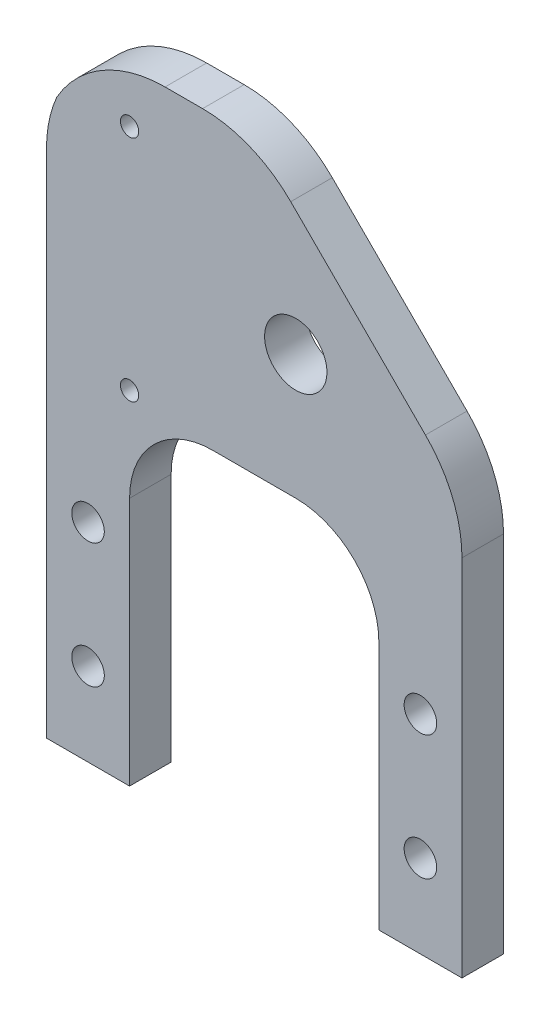
ISO-10303-21;
HEADER;
FILE_DESCRIPTION(('STEP AP214'),'2;1');
FILE_NAME('part.step','',(''),(''),'','','');
FILE_SCHEMA(('AUTOMOTIVE_DESIGN { 1 0 10303 214 1 1 1 1 }'));
ENDSEC;
DATA;
#1=APPLICATION_CONTEXT('core data for automotive mechanical design processes');
#2=APPLICATION_PROTOCOL_DEFINITION('international standard','automotive_design',2000,#1);
#3=PRODUCT_CONTEXT('',#1,'mechanical');
#4=PRODUCT('Part','Part','',(#3));
#5=PRODUCT_RELATED_PRODUCT_CATEGORY('part','',(#4));
#6=PRODUCT_DEFINITION_FORMATION('','',#4);
#7=PRODUCT_DEFINITION_CONTEXT('part definition',#1,'design');
#8=PRODUCT_DEFINITION('design','',#6,#7);
#9=PRODUCT_DEFINITION_SHAPE('','',#8);
#10=(LENGTH_UNIT() NAMED_UNIT(*) SI_UNIT(.MILLI.,.METRE.));
#11=(NAMED_UNIT(*) PLANE_ANGLE_UNIT() SI_UNIT($,.RADIAN.));
#12=(NAMED_UNIT(*) SI_UNIT($,.STERADIAN.) SOLID_ANGLE_UNIT());
#13=UNCERTAINTY_MEASURE_WITH_UNIT(LENGTH_MEASURE(1.E-05),#10,'distance_accuracy_value','');
#14=(GEOMETRIC_REPRESENTATION_CONTEXT(3) GLOBAL_UNCERTAINTY_ASSIGNED_CONTEXT((#13)) GLOBAL_UNIT_ASSIGNED_CONTEXT((#10,
#11,#12)) REPRESENTATION_CONTEXT('',''));
#15=CARTESIAN_POINT('',(0.,0.,0.));
#16=DIRECTION('',(0.,0.,1.));
#17=DIRECTION('',(1.,0.,0.));
#18=AXIS2_PLACEMENT_3D('',#15,#16,#17);
#19=CARTESIAN_POINT('',(0.,0.,6.35));
#20=DIRECTION('',(1.,0.,0.));
#21=DIRECTION('',(0.,0.,-1.));
#22=AXIS2_PLACEMENT_3D('',#19,#20,#21);
#23=PLANE('',#22);
#24=DIRECTION('',(0.,-1.,0.));
#25=VECTOR('',#24,1.);
#26=CARTESIAN_POINT('',(0.,0.,6.35));
#27=LINE('',#26,#25);
#28=CARTESIAN_POINT('',(0.,78.052905028629,6.35));
#29=VERTEX_POINT('',#28);
#30=CARTESIAN_POINT('',(0.,0.,6.35));
#31=VERTEX_POINT('',#30);
#32=EDGE_CURVE('E142',#29,#31,#27,.T.);
#33=ORIENTED_EDGE('',*,*,#32,.F.);
#34=DIRECTION('',(0.,0.,-1.));
#35=VECTOR('',#34,1.);
#36=CARTESIAN_POINT('',(0.,78.052905028629,6.35));
#37=LINE('',#36,#35);
#38=CARTESIAN_POINT('',(0.,78.052905028629,0.));
#39=VERTEX_POINT('',#38);
#40=EDGE_CURVE('E44',#29,#39,#37,.T.);
#41=ORIENTED_EDGE('',*,*,#40,.T.);
#42=DIRECTION('',(0.,-1.,0.));
#43=VECTOR('',#42,1.);
#44=CARTESIAN_POINT('',(0.,0.,0.));
#45=LINE('',#44,#43);
#46=CARTESIAN_POINT('',(0.,0.,0.));
#47=VERTEX_POINT('',#46);
#48=EDGE_CURVE('E167',#39,#47,#45,.T.);
#49=ORIENTED_EDGE('',*,*,#48,.T.);
#50=DIRECTION('',(0.,0.,-1.));
#51=VECTOR('',#50,1.);
#52=CARTESIAN_POINT('',(0.,0.,6.35));
#53=LINE('',#52,#51);
#54=EDGE_CURVE('E160',#31,#47,#53,.T.);
#55=ORIENTED_EDGE('',*,*,#54,.F.);
#56=EDGE_LOOP('',(#33,#41,#49,#55));
#57=FACE_BOUND('',#56,.T.);
#58=ADVANCED_FACE('F35',(#57),#23,.F.);
#59=CARTESIAN_POINT('',(0.,0.,6.35));
#60=DIRECTION('',(0.,1.,0.));
#61=DIRECTION('',(0.,0.,1.));
#62=AXIS2_PLACEMENT_3D('',#59,#60,#61);
#63=PLANE('',#62);
#64=DIRECTION('',(1.,0.,0.));
#65=VECTOR('',#64,1.);
#66=CARTESIAN_POINT('',(0.,0.,0.));
#67=LINE('',#66,#65);
#68=CARTESIAN_POINT('',(12.7,0.,0.));
#69=VERTEX_POINT('',#68);
#70=EDGE_CURVE('E222',#47,#69,#67,.T.);
#71=ORIENTED_EDGE('',*,*,#70,.T.);
#72=DIRECTION('',(0.,0.,-1.));
#73=VECTOR('',#72,1.);
#74=CARTESIAN_POINT('',(12.7,0.,6.35));
#75=LINE('',#74,#73);
#76=CARTESIAN_POINT('',(12.7,0.,6.35));
#77=VERTEX_POINT('',#76);
#78=EDGE_CURVE('E162',#77,#69,#75,.T.);
#79=ORIENTED_EDGE('',*,*,#78,.F.);
#80=DIRECTION('',(1.,0.,0.));
#81=VECTOR('',#80,1.);
#82=CARTESIAN_POINT('',(0.,0.,6.35));
#83=LINE('',#82,#81);
#84=EDGE_CURVE('E147',#31,#77,#83,.T.);
#85=ORIENTED_EDGE('',*,*,#84,.F.);
#86=ORIENTED_EDGE('',*,*,#54,.T.);
#87=EDGE_LOOP('',(#71,#79,#85,#86));
#88=FACE_BOUND('',#87,.T.);
#89=ADVANCED_FACE('F159',(#88),#63,.F.);
#90=CARTESIAN_POINT('',(12.7,0.,6.35));
#91=DIRECTION('',(-1.,0.,0.));
#92=DIRECTION('',(0.,0.,1.));
#93=AXIS2_PLACEMENT_3D('',#90,#91,#92);
#94=PLANE('',#93);
#95=DIRECTION('',(0.,1.,0.));
#96=VECTOR('',#95,1.);
#97=CARTESIAN_POINT('',(12.7,0.,0.));
#98=LINE('',#97,#96);
#99=CARTESIAN_POINT('',(12.7,38.1,0.));
#100=VERTEX_POINT('',#99);
#101=EDGE_CURVE('E225',#69,#100,#98,.T.);
#102=ORIENTED_EDGE('',*,*,#101,.T.);
#103=DIRECTION('',(0.,0.,-1.));
#104=VECTOR('',#103,1.);
#105=CARTESIAN_POINT('',(12.7,38.1,6.35));
#106=LINE('',#105,#104);
#107=CARTESIAN_POINT('',(12.7,38.1,6.35));
#108=VERTEX_POINT('',#107);
#109=EDGE_CURVE('E182',#100,#108,#106,.F.);
#110=ORIENTED_EDGE('',*,*,#109,.T.);
#111=DIRECTION('',(0.,1.,0.));
#112=VECTOR('',#111,1.);
#113=CARTESIAN_POINT('',(12.7,0.,6.35));
#114=LINE('',#113,#112);
#115=EDGE_CURVE('E164',#77,#108,#114,.T.);
#116=ORIENTED_EDGE('',*,*,#115,.F.);
#117=ORIENTED_EDGE('',*,*,#78,.T.);
#118=EDGE_LOOP('',(#102,#110,#116,#117));
#119=FACE_BOUND('',#118,.T.);
#120=ADVANCED_FACE('F363',(#119),#94,.F.);
#121=CARTESIAN_POINT('',(12.7,50.8,6.35));
#122=DIRECTION('',(0.,1.,0.));
#123=DIRECTION('',(0.,0.,1.));
#124=AXIS2_PLACEMENT_3D('',#121,#122,#123);
#125=PLANE('',#124);
#126=DIRECTION('',(1.,0.,0.));
#127=VECTOR('',#126,1.);
#128=CARTESIAN_POINT('',(12.7,50.8,0.));
#129=LINE('',#128,#127);
#130=CARTESIAN_POINT('',(25.4,50.8,0.));
#131=VERTEX_POINT('',#130);
#132=CARTESIAN_POINT('',(38.1,50.8,0.));
#133=VERTEX_POINT('',#132);
#134=EDGE_CURVE('E236',#131,#133,#129,.T.);
#135=ORIENTED_EDGE('',*,*,#134,.T.);
#136=DIRECTION('',(0.,0.,-1.));
#137=VECTOR('',#136,1.);
#138=CARTESIAN_POINT('',(38.1,50.8,6.35));
#139=LINE('',#138,#137);
#140=CARTESIAN_POINT('',(38.1,50.8,6.35));
#141=VERTEX_POINT('',#140);
#142=EDGE_CURVE('E180',#133,#141,#139,.F.);
#143=ORIENTED_EDGE('',*,*,#142,.T.);
#144=DIRECTION('',(1.,0.,0.));
#145=VECTOR('',#144,1.);
#146=CARTESIAN_POINT('',(12.7,50.8,6.35));
#147=LINE('',#146,#145);
#148=CARTESIAN_POINT('',(25.4,50.8,6.35));
#149=VERTEX_POINT('',#148);
#150=EDGE_CURVE('E281',#149,#141,#147,.T.);
#151=ORIENTED_EDGE('',*,*,#150,.F.);
#152=DIRECTION('',(0.,0.,-1.));
#153=VECTOR('',#152,1.);
#154=CARTESIAN_POINT('',(25.4,50.8,0.));
#155=LINE('',#154,#153);
#156=EDGE_CURVE('E172',#149,#131,#155,.T.);
#157=ORIENTED_EDGE('',*,*,#156,.T.);
#158=EDGE_LOOP('',(#135,#143,#151,#157));
#159=FACE_BOUND('',#158,.T.);
#160=ADVANCED_FACE('F405',(#159),#125,.F.);
#161=CARTESIAN_POINT('',(50.8,50.8,6.35));
#162=DIRECTION('',(1.,0.,0.));
#163=DIRECTION('',(0.,0.,-1.));
#164=AXIS2_PLACEMENT_3D('',#161,#162,#163);
#165=PLANE('',#164);
#166=DIRECTION('',(0.,-1.,0.));
#167=VECTOR('',#166,1.);
#168=CARTESIAN_POINT('',(50.8,50.8,6.35));
#169=LINE('',#168,#167);
#170=CARTESIAN_POINT('',(50.8,38.1,6.35));
#171=VERTEX_POINT('',#170);
#172=CARTESIAN_POINT('',(50.8,0.,6.35));
#173=VERTEX_POINT('',#172);
#174=EDGE_CURVE('E279',#171,#173,#169,.T.);
#175=ORIENTED_EDGE('',*,*,#174,.F.);
#176=DIRECTION('',(0.,0.,-1.));
#177=VECTOR('',#176,1.);
#178=CARTESIAN_POINT('',(50.8,38.1,0.));
#179=LINE('',#178,#177);
#180=CARTESIAN_POINT('',(50.8,38.1,0.));
#181=VERTEX_POINT('',#180);
#182=EDGE_CURVE('E169',#171,#181,#179,.T.);
#183=ORIENTED_EDGE('',*,*,#182,.T.);
#184=DIRECTION('',(0.,-1.,0.));
#185=VECTOR('',#184,1.);
#186=CARTESIAN_POINT('',(50.8,50.8,0.));
#187=LINE('',#186,#185);
#188=CARTESIAN_POINT('',(50.8,0.,0.));
#189=VERTEX_POINT('',#188);
#190=EDGE_CURVE('E239',#181,#189,#187,.T.);
#191=ORIENTED_EDGE('',*,*,#190,.T.);
#192=DIRECTION('',(0.,0.,-1.));
#193=VECTOR('',#192,1.);
#194=CARTESIAN_POINT('',(50.8,0.,6.35));
#195=LINE('',#194,#193);
#196=EDGE_CURVE('E174',#173,#189,#195,.T.);
#197=ORIENTED_EDGE('',*,*,#196,.F.);
#198=EDGE_LOOP('',(#175,#183,#191,#197));
#199=FACE_BOUND('',#198,.T.);
#200=ADVANCED_FACE('F402',(#199),#165,.F.);
#201=CARTESIAN_POINT('',(50.8,0.,6.35));
#202=DIRECTION('',(0.,1.,0.));
#203=DIRECTION('',(0.,0.,1.));
#204=AXIS2_PLACEMENT_3D('',#201,#202,#203);
#205=PLANE('',#204);
#206=DIRECTION('',(1.,0.,0.));
#207=VECTOR('',#206,1.);
#208=CARTESIAN_POINT('',(50.8,0.,0.));
#209=LINE('',#208,#207);
#210=CARTESIAN_POINT('',(63.5,0.,0.));
#211=VERTEX_POINT('',#210);
#212=EDGE_CURVE('E241',#189,#211,#209,.T.);
#213=ORIENTED_EDGE('',*,*,#212,.T.);
#214=DIRECTION('',(0.,0.,-1.));
#215=VECTOR('',#214,1.);
#216=CARTESIAN_POINT('',(63.5,0.,6.35));
#217=LINE('',#216,#215);
#218=CARTESIAN_POINT('',(63.5,0.,6.35));
#219=VERTEX_POINT('',#218);
#220=EDGE_CURVE('E250',#219,#211,#217,.T.);
#221=ORIENTED_EDGE('',*,*,#220,.F.);
#222=DIRECTION('',(1.,0.,0.));
#223=VECTOR('',#222,1.);
#224=CARTESIAN_POINT('',(50.8,0.,6.35));
#225=LINE('',#224,#223);
#226=EDGE_CURVE('E259',#173,#219,#225,.T.);
#227=ORIENTED_EDGE('',*,*,#226,.F.);
#228=ORIENTED_EDGE('',*,*,#196,.T.);
#229=EDGE_LOOP('',(#213,#221,#227,#228));
#230=FACE_BOUND('',#229,.T.);
#231=ADVANCED_FACE('F257',(#230),#205,.F.);
#232=CARTESIAN_POINT('',(63.5,0.,6.35));
#233=DIRECTION('',(-1.,0.,0.));
#234=DIRECTION('',(0.,0.,1.));
#235=AXIS2_PLACEMENT_3D('',#232,#233,#234);
#236=PLANE('',#235);
#237=DIRECTION('',(0.,1.,0.));
#238=VECTOR('',#237,1.);
#239=CARTESIAN_POINT('',(63.5,0.,0.));
#240=LINE('',#239,#238);
#241=CARTESIAN_POINT('',(63.5,55.6092316367925,0.));
#242=VERTEX_POINT('',#241);
#243=EDGE_CURVE('E243',#211,#242,#240,.T.);
#244=ORIENTED_EDGE('',*,*,#243,.T.);
#245=DIRECTION('',(0.,0.,-1.));
#246=VECTOR('',#245,1.);
#247=CARTESIAN_POINT('',(63.5,55.6092316367925,6.35));
#248=LINE('',#247,#246);
#249=CARTESIAN_POINT('',(63.5,55.6092316367925,6.35));
#250=VERTEX_POINT('',#249);
#251=EDGE_CURVE('E11',#242,#250,#248,.F.);
#252=ORIENTED_EDGE('',*,*,#251,.T.);
#253=DIRECTION('',(0.,1.,0.));
#254=VECTOR('',#253,1.);
#255=CARTESIAN_POINT('',(63.5,0.,6.35));
#256=LINE('',#255,#254);
#257=EDGE_CURVE('E272',#219,#250,#256,.T.);
#258=ORIENTED_EDGE('',*,*,#257,.F.);
#259=ORIENTED_EDGE('',*,*,#220,.T.);
#260=EDGE_LOOP('',(#244,#252,#258,#259));
#261=FACE_BOUND('',#260,.T.);
#262=ADVANCED_FACE('F265',(#261),#236,.F.);
#263=CARTESIAN_POINT('',(31.75,95.25,6.35));
#264=DIRECTION('',(-0.707106781186548,-0.707106781186548,0.));
#265=DIRECTION('',(0.707106781186548,-0.707106781186548,0.));
#266=AXIS2_PLACEMENT_3D('',#263,#264,#265);
#267=PLANE('',#266);
#268=DIRECTION('',(-0.707106781186548,0.707106781186548,0.));
#269=VECTOR('',#268,1.);
#270=CARTESIAN_POINT('',(31.75,95.25,0.));
#271=LINE('',#270,#269);
#272=CARTESIAN_POINT('',(57.9203841816037,69.0796158183963,0.));
#273=VERTEX_POINT('',#272);
#274=CARTESIAN_POINT('',(37.3296158183963,89.6703841816037,0.));
#275=VERTEX_POINT('',#274);
#276=EDGE_CURVE('E245',#273,#275,#271,.T.);
#277=ORIENTED_EDGE('',*,*,#276,.T.);
#278=DIRECTION('',(0.,0.,-1.));
#279=VECTOR('',#278,1.);
#280=CARTESIAN_POINT('',(37.3296158183963,89.6703841816037,6.35));
#281=LINE('',#280,#279);
#282=CARTESIAN_POINT('',(37.3296158183963,89.6703841816037,6.35));
#283=VERTEX_POINT('',#282);
#284=EDGE_CURVE('E208',#275,#283,#281,.F.);
#285=ORIENTED_EDGE('',*,*,#284,.T.);
#286=DIRECTION('',(-0.707106781186548,0.707106781186548,0.));
#287=VECTOR('',#286,1.);
#288=CARTESIAN_POINT('',(31.75,95.25,6.35));
#289=LINE('',#288,#287);
#290=CARTESIAN_POINT('',(57.9203841816037,69.0796158183963,6.35));
#291=VERTEX_POINT('',#290);
#292=EDGE_CURVE('E270',#291,#283,#289,.T.);
#293=ORIENTED_EDGE('',*,*,#292,.F.);
#294=DIRECTION('',(0.,0.,-1.));
#295=VECTOR('',#294,1.);
#296=CARTESIAN_POINT('',(57.9203841816037,69.0796158183963,6.35));
#297=LINE('',#296,#295);
#298=EDGE_CURVE('E205',#291,#273,#297,.T.);
#299=ORIENTED_EDGE('',*,*,#298,.T.);
#300=EDGE_LOOP('',(#277,#285,#293,#299));
#301=FACE_BOUND('',#300,.T.);
#302=ADVANCED_FACE('F274',(#301),#267,.F.);
#303=CARTESIAN_POINT('',(6.35,95.25,6.35));
#304=DIRECTION('',(0.,-1.,0.));
#305=DIRECTION('',(0.,0.,-1.));
#306=AXIS2_PLACEMENT_3D('',#303,#304,#305);
#307=PLANE('',#306);
#308=DIRECTION('',(-1.,0.,0.));
#309=VECTOR('',#308,1.);
#310=CARTESIAN_POINT('',(6.35,95.25,6.35));
#311=LINE('',#310,#309);
#312=CARTESIAN_POINT('',(23.8592316367925,95.25,6.35));
#313=VERTEX_POINT('',#312);
#314=CARTESIAN_POINT('',(18.1235474856855,95.25,6.35));
#315=VERTEX_POINT('',#314);
#316=EDGE_CURVE('E231',#313,#315,#311,.T.);
#317=ORIENTED_EDGE('',*,*,#316,.F.);
#318=DIRECTION('',(0.,0.,-1.));
#319=VECTOR('',#318,1.);
#320=CARTESIAN_POINT('',(23.8592316367925,95.25,6.35));
#321=LINE('',#320,#319);
#322=CARTESIAN_POINT('',(23.8592316367925,95.25,0.));
#323=VERTEX_POINT('',#322);
#324=EDGE_CURVE('E194',#313,#323,#321,.T.);
#325=ORIENTED_EDGE('',*,*,#324,.T.);
#326=DIRECTION('',(-1.,0.,0.));
#327=VECTOR('',#326,1.);
#328=CARTESIAN_POINT('',(6.35,95.25,0.));
#329=LINE('',#328,#327);
#330=CARTESIAN_POINT('',(18.1235474856855,95.25,0.));
#331=VERTEX_POINT('',#330);
#332=EDGE_CURVE('E155',#323,#331,#329,.T.);
#333=ORIENTED_EDGE('',*,*,#332,.T.);
#334=DIRECTION('',(0.,0.,-1.));
#335=VECTOR('',#334,1.);
#336=CARTESIAN_POINT('',(18.1235474856855,95.25,6.35));
#337=LINE('',#336,#335);
#338=EDGE_CURVE('E192',#331,#315,#337,.F.);
#339=ORIENTED_EDGE('',*,*,#338,.T.);
#340=EDGE_LOOP('',(#317,#325,#333,#339));
#341=FACE_BOUND('',#340,.T.);
#342=ADVANCED_FACE('F328',(#341),#307,.F.);
#343=CARTESIAN_POINT('',(0.,0.,6.35));
#344=DIRECTION('',(0.,0.,-1.));
#345=DIRECTION('',(-1.,0.,0.));
#346=AXIS2_PLACEMENT_3D('',#343,#344,#345);
#347=PLANE('',#346);
#348=CARTESIAN_POINT('',(12.7,52.3875,6.35));
#349=DIRECTION('',(0.,0.,1.));
#350=DIRECTION('',(1.,0.,0.));
#351=AXIS2_PLACEMENT_3D('',#348,#349,#350);
#352=CIRCLE('',#351,1.39700000000001);
#353=CARTESIAN_POINT('',(14.097,52.3875,6.35));
#354=VERTEX_POINT('',#353);
#355=EDGE_CURVE('E303',#354,#354,#352,.T.);
#356=ORIENTED_EDGE('',*,*,#355,.F.);
#357=EDGE_LOOP('',(#356));
#358=FACE_BOUND('',#357,.T.);
#359=CARTESIAN_POINT('',(12.7,87.3125,6.35));
#360=DIRECTION('',(0.,0.,1.));
#361=DIRECTION('',(1.,0.,0.));
#362=AXIS2_PLACEMENT_3D('',#359,#360,#361);
#363=CIRCLE('',#362,1.39700000000001);
#364=CARTESIAN_POINT('',(14.097,87.3125,6.35));
#365=VERTEX_POINT('',#364);
#366=EDGE_CURVE('E315',#365,#365,#363,.T.);
#367=ORIENTED_EDGE('',*,*,#366,.F.);
#368=EDGE_LOOP('',(#367));
#369=FACE_BOUND('',#368,.T.);
#370=CARTESIAN_POINT('',(38.1,69.85,6.35));
#371=DIRECTION('',(0.,0.,1.));
#372=DIRECTION('',(1.,0.,0.));
#373=AXIS2_PLACEMENT_3D('',#370,#371,#372);
#374=CIRCLE('',#373,4.7625);
#375=CARTESIAN_POINT('',(42.8625,69.85,6.35));
#376=VERTEX_POINT('',#375);
#377=EDGE_CURVE('E309',#376,#376,#374,.T.);
#378=ORIENTED_EDGE('',*,*,#377,.F.);
#379=EDGE_LOOP('',(#378));
#380=FACE_BOUND('',#379,.T.);
#381=CARTESIAN_POINT('',(6.35,31.75,6.35));
#382=DIRECTION('',(0.,0.,1.));
#383=DIRECTION('',(1.,0.,0.));
#384=AXIS2_PLACEMENT_3D('',#381,#382,#383);
#385=CIRCLE('',#384,2.4892);
#386=CARTESIAN_POINT('',(8.83919999999999,31.75,6.35));
#387=VERTEX_POINT('',#386);
#388=EDGE_CURVE('E286',#387,#387,#385,.T.);
#389=ORIENTED_EDGE('',*,*,#388,.F.);
#390=EDGE_LOOP('',(#389));
#391=FACE_BOUND('',#390,.T.);
#392=CARTESIAN_POINT('',(57.15,12.7,6.35));
#393=DIRECTION('',(0.,0.,1.));
#394=DIRECTION('',(1.,0.,0.));
#395=AXIS2_PLACEMENT_3D('',#392,#393,#394);
#396=CIRCLE('',#395,2.4892);
#397=CARTESIAN_POINT('',(59.6392,12.7,6.35));
#398=VERTEX_POINT('',#397);
#399=EDGE_CURVE('E291',#398,#398,#396,.T.);
#400=ORIENTED_EDGE('',*,*,#399,.F.);
#401=EDGE_LOOP('',(#400));
#402=FACE_BOUND('',#401,.T.);
#403=CARTESIAN_POINT('',(57.15,31.75,6.35));
#404=DIRECTION('',(0.,0.,1.));
#405=DIRECTION('',(1.,0.,0.));
#406=AXIS2_PLACEMENT_3D('',#403,#404,#405);
#407=CIRCLE('',#406,2.4892);
#408=CARTESIAN_POINT('',(59.6392,31.75,6.35));
#409=VERTEX_POINT('',#408);
#410=EDGE_CURVE('E292',#409,#409,#407,.T.);
#411=ORIENTED_EDGE('',*,*,#410,.F.);
#412=EDGE_LOOP('',(#411));
#413=FACE_BOUND('',#412,.T.);
#414=CARTESIAN_POINT('',(6.35,12.7,6.35));
#415=DIRECTION('',(0.,0.,1.));
#416=DIRECTION('',(1.,0.,0.));
#417=AXIS2_PLACEMENT_3D('',#414,#415,#416);
#418=CIRCLE('',#417,2.4892);
#419=CARTESIAN_POINT('',(8.83919999999999,12.7,6.35));
#420=VERTEX_POINT('',#419);
#421=EDGE_CURVE('E223',#420,#420,#418,.T.);
#422=ORIENTED_EDGE('',*,*,#421,.F.);
#423=EDGE_LOOP('',(#422));
#424=FACE_BOUND('',#423,.T.);
#425=ORIENTED_EDGE('',*,*,#292,.T.);
#426=CARTESIAN_POINT('',(23.8592316367925,76.2,6.35));
#427=DIRECTION('',(0.,0.,-1.));
#428=DIRECTION('',(-1.,0.,0.));
#429=AXIS2_PLACEMENT_3D('',#426,#427,#428);
#430=CIRCLE('',#429,19.05);
#431=EDGE_CURVE('E214',#283,#313,#430,.F.);
#432=ORIENTED_EDGE('',*,*,#431,.T.);
#433=ORIENTED_EDGE('',*,*,#316,.T.);
#434=CARTESIAN_POINT('',(18.1235474856855,76.2,6.35));
#435=DIRECTION('',(0.,0.,-1.));
#436=DIRECTION('',(-1.,0.,0.));
#437=AXIS2_PLACEMENT_3D('',#434,#435,#436);
#438=CIRCLE('',#437,19.05);
#439=CARTESIAN_POINT('',(1.57314139290877,85.6332686892815,6.35));
#440=VERTEX_POINT('',#439);
#441=EDGE_CURVE('E51',#315,#440,#438,.F.);
#442=ORIENTED_EDGE('',*,*,#441,.T.);
#443=CARTESIAN_POINT('',(19.05,78.052905028629,6.35));
#444=DIRECTION('',(0.,0.,-1.));
#445=DIRECTION('',(-1.,0.,0.));
#446=AXIS2_PLACEMENT_3D('',#443,#444,#445);
#447=CIRCLE('',#446,19.05);
#448=EDGE_CURVE('E150',#440,#29,#447,.F.);
#449=ORIENTED_EDGE('',*,*,#448,.T.);
#450=ORIENTED_EDGE('',*,*,#32,.T.);
#451=ORIENTED_EDGE('',*,*,#84,.T.);
#452=ORIENTED_EDGE('',*,*,#115,.T.);
#453=CARTESIAN_POINT('',(25.4,38.1,6.35));
#454=DIRECTION('',(0.,0.,-1.));
#455=DIRECTION('',(-1.,0.,0.));
#456=AXIS2_PLACEMENT_3D('',#453,#454,#455);
#457=CIRCLE('',#456,12.7);
#458=EDGE_CURVE('E190',#108,#149,#457,.T.);
#459=ORIENTED_EDGE('',*,*,#458,.T.);
#460=ORIENTED_EDGE('',*,*,#150,.T.);
#461=CARTESIAN_POINT('',(38.1,38.1,6.35));
#462=DIRECTION('',(0.,0.,-1.));
#463=DIRECTION('',(-1.,0.,0.));
#464=AXIS2_PLACEMENT_3D('',#461,#462,#463);
#465=CIRCLE('',#464,12.7);
#466=EDGE_CURVE('E186',#141,#171,#465,.T.);
#467=ORIENTED_EDGE('',*,*,#466,.T.);
#468=ORIENTED_EDGE('',*,*,#174,.T.);
#469=ORIENTED_EDGE('',*,*,#226,.T.);
#470=ORIENTED_EDGE('',*,*,#257,.T.);
#471=CARTESIAN_POINT('',(44.45,55.6092316367925,6.35));
#472=DIRECTION('',(0.,0.,-1.));
#473=DIRECTION('',(-1.,0.,0.));
#474=AXIS2_PLACEMENT_3D('',#471,#472,#473);
#475=CIRCLE('',#474,19.05);
#476=EDGE_CURVE('E210',#250,#291,#475,.F.);
#477=ORIENTED_EDGE('',*,*,#476,.T.);
#478=EDGE_LOOP('',(#425,#432,#433,#442,#449,#450,#451,#452,#459,#460,#467,#468,#469,#470,#477));
#479=FACE_BOUND('',#478,.T.);
#480=ADVANCED_FACE('F145',(#358,#369,#380,#391,#402,#413,#424,#479),#347,.F.);
#481=CARTESIAN_POINT('',(0.,0.,0.));
#482=DIRECTION('',(0.,0.,-1.));
#483=DIRECTION('',(-1.,0.,0.));
#484=AXIS2_PLACEMENT_3D('',#481,#482,#483);
#485=PLANE('',#484);
#486=CARTESIAN_POINT('',(12.7,52.3875,0.));
#487=DIRECTION('',(0.,0.,-1.));
#488=DIRECTION('',(-1.,0.,0.));
#489=AXIS2_PLACEMENT_3D('',#486,#487,#488);
#490=CIRCLE('',#489,1.39700000000001);
#491=CARTESIAN_POINT('',(11.303,52.3875,0.));
#492=VERTEX_POINT('',#491);
#493=EDGE_CURVE('E318',#492,#492,#490,.F.);
#494=ORIENTED_EDGE('',*,*,#493,.T.);
#495=EDGE_LOOP('',(#494));
#496=FACE_BOUND('',#495,.T.);
#497=CARTESIAN_POINT('',(12.7,87.3125,0.));
#498=DIRECTION('',(0.,0.,-1.));
#499=DIRECTION('',(-1.,0.,0.));
#500=AXIS2_PLACEMENT_3D('',#497,#498,#499);
#501=CIRCLE('',#500,1.39700000000001);
#502=CARTESIAN_POINT('',(11.303,87.3125,0.));
#503=VERTEX_POINT('',#502);
#504=EDGE_CURVE('E312',#503,#503,#501,.F.);
#505=ORIENTED_EDGE('',*,*,#504,.T.);
#506=EDGE_LOOP('',(#505));
#507=FACE_BOUND('',#506,.T.);
#508=CARTESIAN_POINT('',(38.1,69.85,0.));
#509=DIRECTION('',(0.,0.,-1.));
#510=DIRECTION('',(-1.,0.,0.));
#511=AXIS2_PLACEMENT_3D('',#508,#509,#510);
#512=CIRCLE('',#511,4.7625);
#513=CARTESIAN_POINT('',(33.3375,69.85,0.));
#514=VERTEX_POINT('',#513);
#515=EDGE_CURVE('E306',#514,#514,#512,.F.);
#516=ORIENTED_EDGE('',*,*,#515,.T.);
#517=EDGE_LOOP('',(#516));
#518=FACE_BOUND('',#517,.T.);
#519=CARTESIAN_POINT('',(6.35,31.75,0.));
#520=DIRECTION('',(0.,0.,-1.));
#521=DIRECTION('',(-1.,0.,0.));
#522=AXIS2_PLACEMENT_3D('',#519,#520,#521);
#523=CIRCLE('',#522,2.4892);
#524=CARTESIAN_POINT('',(3.8608,31.75,0.));
#525=VERTEX_POINT('',#524);
#526=EDGE_CURVE('E295',#525,#525,#523,.F.);
#527=ORIENTED_EDGE('',*,*,#526,.T.);
#528=EDGE_LOOP('',(#527));
#529=FACE_BOUND('',#528,.T.);
#530=CARTESIAN_POINT('',(57.15,12.7,0.));
#531=DIRECTION('',(0.,0.,-1.));
#532=DIRECTION('',(-1.,0.,0.));
#533=AXIS2_PLACEMENT_3D('',#530,#531,#532);
#534=CIRCLE('',#533,2.4892);
#535=CARTESIAN_POINT('',(54.6608,12.7,0.));
#536=VERTEX_POINT('',#535);
#537=EDGE_CURVE('E288',#536,#536,#534,.F.);
#538=ORIENTED_EDGE('',*,*,#537,.T.);
#539=EDGE_LOOP('',(#538));
#540=FACE_BOUND('',#539,.T.);
#541=CARTESIAN_POINT('',(57.15,31.75,0.));
#542=DIRECTION('',(0.,0.,-1.));
#543=DIRECTION('',(-1.,0.,0.));
#544=AXIS2_PLACEMENT_3D('',#541,#542,#543);
#545=CIRCLE('',#544,2.4892);
#546=CARTESIAN_POINT('',(54.6608,31.75,0.));
#547=VERTEX_POINT('',#546);
#548=EDGE_CURVE('E300',#547,#547,#545,.F.);
#549=ORIENTED_EDGE('',*,*,#548,.T.);
#550=EDGE_LOOP('',(#549));
#551=FACE_BOUND('',#550,.T.);
#552=CARTESIAN_POINT('',(6.35,12.7,0.));
#553=DIRECTION('',(0.,0.,-1.));
#554=DIRECTION('',(-1.,0.,0.));
#555=AXIS2_PLACEMENT_3D('',#552,#553,#554);
#556=CIRCLE('',#555,2.4892);
#557=CARTESIAN_POINT('',(3.8608,12.7,0.));
#558=VERTEX_POINT('',#557);
#559=EDGE_CURVE('E228',#558,#558,#556,.F.);
#560=ORIENTED_EDGE('',*,*,#559,.T.);
#561=EDGE_LOOP('',(#560));
#562=FACE_BOUND('',#561,.T.);
#563=ORIENTED_EDGE('',*,*,#332,.F.);
#564=CARTESIAN_POINT('',(23.8592316367925,76.2,0.));
#565=DIRECTION('',(0.,0.,-1.));
#566=DIRECTION('',(-1.,0.,0.));
#567=AXIS2_PLACEMENT_3D('',#564,#565,#566);
#568=CIRCLE('',#567,19.05);
#569=EDGE_CURVE('E203',#323,#275,#568,.T.);
#570=ORIENTED_EDGE('',*,*,#569,.T.);
#571=ORIENTED_EDGE('',*,*,#276,.F.);
#572=CARTESIAN_POINT('',(44.45,55.6092316367925,0.));
#573=DIRECTION('',(0.,0.,-1.));
#574=DIRECTION('',(-1.,0.,0.));
#575=AXIS2_PLACEMENT_3D('',#572,#573,#574);
#576=CIRCLE('',#575,19.05);
#577=EDGE_CURVE('E197',#273,#242,#576,.T.);
#578=ORIENTED_EDGE('',*,*,#577,.T.);
#579=ORIENTED_EDGE('',*,*,#243,.F.);
#580=ORIENTED_EDGE('',*,*,#212,.F.);
#581=ORIENTED_EDGE('',*,*,#190,.F.);
#582=CARTESIAN_POINT('',(38.1,38.1,0.));
#583=DIRECTION('',(0.,0.,-1.));
#584=DIRECTION('',(-1.,0.,0.));
#585=AXIS2_PLACEMENT_3D('',#582,#583,#584);
#586=CIRCLE('',#585,12.7);
#587=EDGE_CURVE('E184',#181,#133,#586,.F.);
#588=ORIENTED_EDGE('',*,*,#587,.T.);
#589=ORIENTED_EDGE('',*,*,#134,.F.);
#590=CARTESIAN_POINT('',(25.4,38.1,0.));
#591=DIRECTION('',(0.,0.,-1.));
#592=DIRECTION('',(-1.,0.,0.));
#593=AXIS2_PLACEMENT_3D('',#590,#591,#592);
#594=CIRCLE('',#593,12.7);
#595=EDGE_CURVE('E188',#131,#100,#594,.F.);
#596=ORIENTED_EDGE('',*,*,#595,.T.);
#597=ORIENTED_EDGE('',*,*,#101,.F.);
#598=ORIENTED_EDGE('',*,*,#70,.F.);
#599=ORIENTED_EDGE('',*,*,#48,.F.);
#600=CARTESIAN_POINT('',(19.05,78.052905028629,0.));
#601=DIRECTION('',(0.,0.,-1.));
#602=DIRECTION('',(-1.,0.,0.));
#603=AXIS2_PLACEMENT_3D('',#600,#601,#602);
#604=CIRCLE('',#603,19.05);
#605=CARTESIAN_POINT('',(1.57314139290877,85.6332686892815,0.));
#606=VERTEX_POINT('',#605);
#607=EDGE_CURVE('E201',#39,#606,#604,.T.);
#608=ORIENTED_EDGE('',*,*,#607,.T.);
#609=CARTESIAN_POINT('',(18.1235474856855,76.2,0.));
#610=DIRECTION('',(0.,0.,-1.));
#611=DIRECTION('',(-1.,0.,0.));
#612=AXIS2_PLACEMENT_3D('',#609,#610,#611);
#613=CIRCLE('',#612,19.05);
#614=EDGE_CURVE('E199',#606,#331,#613,.T.);
#615=ORIENTED_EDGE('',*,*,#614,.T.);
#616=EDGE_LOOP('',(#563,#570,#571,#578,#579,#580,#581,#588,#589,#596,#597,#598,#599,#608,#615));
#617=FACE_BOUND('',#616,.T.);
#618=ADVANCED_FACE('F219',(#496,#507,#518,#529,#540,#551,#562,#617),#485,.T.);
#619=CARTESIAN_POINT('',(6.35,12.7,-0.00100000000000013));
#620=DIRECTION('',(0.,0.,1.));
#621=DIRECTION('',(1.,0.,0.));
#622=AXIS2_PLACEMENT_3D('',#619,#620,#621);
#623=CYLINDRICAL_SURFACE('',#622,2.4892);
#624=ORIENTED_EDGE('',*,*,#559,.F.);
#625=EDGE_LOOP('',(#624));
#626=FACE_BOUND('',#625,.T.);
#627=ORIENTED_EDGE('',*,*,#421,.T.);
#628=EDGE_LOOP('',(#627));
#629=FACE_BOUND('',#628,.T.);
#630=ADVANCED_FACE('F342',(#626,#629),#623,.F.);
#631=CARTESIAN_POINT('',(57.15,31.75,-0.00100000000000013));
#632=DIRECTION('',(0.,0.,1.));
#633=DIRECTION('',(1.,0.,0.));
#634=AXIS2_PLACEMENT_3D('',#631,#632,#633);
#635=CYLINDRICAL_SURFACE('',#634,2.4892);
#636=ORIENTED_EDGE('',*,*,#548,.F.);
#637=EDGE_LOOP('',(#636));
#638=FACE_BOUND('',#637,.T.);
#639=ORIENTED_EDGE('',*,*,#410,.T.);
#640=EDGE_LOOP('',(#639));
#641=FACE_BOUND('',#640,.T.);
#642=ADVANCED_FACE('F344',(#638,#641),#635,.F.);
#643=CARTESIAN_POINT('',(57.15,12.7,-0.00100000000000013));
#644=DIRECTION('',(0.,0.,1.));
#645=DIRECTION('',(1.,0.,0.));
#646=AXIS2_PLACEMENT_3D('',#643,#644,#645);
#647=CYLINDRICAL_SURFACE('',#646,2.4892);
#648=ORIENTED_EDGE('',*,*,#537,.F.);
#649=EDGE_LOOP('',(#648));
#650=FACE_BOUND('',#649,.T.);
#651=ORIENTED_EDGE('',*,*,#399,.T.);
#652=EDGE_LOOP('',(#651));
#653=FACE_BOUND('',#652,.T.);
#654=ADVANCED_FACE('F351',(#650,#653),#647,.F.);
#655=CARTESIAN_POINT('',(6.35,31.75,-0.00100000000000013));
#656=DIRECTION('',(0.,0.,1.));
#657=DIRECTION('',(1.,0.,0.));
#658=AXIS2_PLACEMENT_3D('',#655,#656,#657);
#659=CYLINDRICAL_SURFACE('',#658,2.4892);
#660=ORIENTED_EDGE('',*,*,#526,.F.);
#661=EDGE_LOOP('',(#660));
#662=FACE_BOUND('',#661,.T.);
#663=ORIENTED_EDGE('',*,*,#388,.T.);
#664=EDGE_LOOP('',(#663));
#665=FACE_BOUND('',#664,.T.);
#666=ADVANCED_FACE('F514',(#662,#665),#659,.F.);
#667=CARTESIAN_POINT('',(38.1,69.85,-0.00100000000000013));
#668=DIRECTION('',(0.,0.,1.));
#669=DIRECTION('',(1.,0.,0.));
#670=AXIS2_PLACEMENT_3D('',#667,#668,#669);
#671=CYLINDRICAL_SURFACE('',#670,4.7625);
#672=ORIENTED_EDGE('',*,*,#515,.F.);
#673=EDGE_LOOP('',(#672));
#674=FACE_BOUND('',#673,.T.);
#675=ORIENTED_EDGE('',*,*,#377,.T.);
#676=EDGE_LOOP('',(#675));
#677=FACE_BOUND('',#676,.T.);
#678=ADVANCED_FACE('F506',(#674,#677),#671,.F.);
#679=CARTESIAN_POINT('',(12.7,87.3125,-0.00100000000000013));
#680=DIRECTION('',(0.,0.,1.));
#681=DIRECTION('',(1.,0.,0.));
#682=AXIS2_PLACEMENT_3D('',#679,#680,#681);
#683=CYLINDRICAL_SURFACE('',#682,1.39700000000001);
#684=ORIENTED_EDGE('',*,*,#504,.F.);
#685=EDGE_LOOP('',(#684));
#686=FACE_BOUND('',#685,.T.);
#687=ORIENTED_EDGE('',*,*,#366,.T.);
#688=EDGE_LOOP('',(#687));
#689=FACE_BOUND('',#688,.T.);
#690=ADVANCED_FACE('F498',(#686,#689),#683,.F.);
#691=CARTESIAN_POINT('',(12.7,52.3875,-0.00100000000000013));
#692=DIRECTION('',(0.,0.,1.));
#693=DIRECTION('',(1.,0.,0.));
#694=AXIS2_PLACEMENT_3D('',#691,#692,#693);
#695=CYLINDRICAL_SURFACE('',#694,1.39700000000001);
#696=ORIENTED_EDGE('',*,*,#493,.F.);
#697=EDGE_LOOP('',(#696));
#698=FACE_BOUND('',#697,.T.);
#699=ORIENTED_EDGE('',*,*,#355,.T.);
#700=EDGE_LOOP('',(#699));
#701=FACE_BOUND('',#700,.T.);
#702=ADVANCED_FACE('F324',(#698,#701),#695,.F.);
#703=CARTESIAN_POINT('',(38.1,38.1,6.35));
#704=DIRECTION('',(0.,0.,1.));
#705=DIRECTION('',(1.,0.,0.));
#706=AXIS2_PLACEMENT_3D('',#703,#704,#705);
#707=CYLINDRICAL_SURFACE('',#706,12.7);
#708=ORIENTED_EDGE('',*,*,#466,.F.);
#709=ORIENTED_EDGE('',*,*,#142,.F.);
#710=ORIENTED_EDGE('',*,*,#587,.F.);
#711=ORIENTED_EDGE('',*,*,#182,.F.);
#712=EDGE_LOOP('',(#708,#709,#710,#711));
#713=FACE_BOUND('',#712,.T.);
#714=ADVANCED_FACE('F367',(#713),#707,.F.);
#715=CARTESIAN_POINT('',(25.4,38.1,6.35));
#716=DIRECTION('',(0.,0.,1.));
#717=DIRECTION('',(1.,0.,0.));
#718=AXIS2_PLACEMENT_3D('',#715,#716,#717);
#719=CYLINDRICAL_SURFACE('',#718,12.7);
#720=ORIENTED_EDGE('',*,*,#458,.F.);
#721=ORIENTED_EDGE('',*,*,#109,.F.);
#722=ORIENTED_EDGE('',*,*,#595,.F.);
#723=ORIENTED_EDGE('',*,*,#156,.F.);
#724=EDGE_LOOP('',(#720,#721,#722,#723));
#725=FACE_BOUND('',#724,.T.);
#726=ADVANCED_FACE('F370',(#725),#719,.F.);
#727=CARTESIAN_POINT('',(23.8592316367925,76.2,6.35));
#728=DIRECTION('',(0.,0.,-1.));
#729=DIRECTION('',(-1.,0.,0.));
#730=AXIS2_PLACEMENT_3D('',#727,#728,#729);
#731=CYLINDRICAL_SURFACE('',#730,19.05);
#732=ORIENTED_EDGE('',*,*,#431,.F.);
#733=ORIENTED_EDGE('',*,*,#284,.F.);
#734=ORIENTED_EDGE('',*,*,#569,.F.);
#735=ORIENTED_EDGE('',*,*,#324,.F.);
#736=EDGE_LOOP('',(#732,#733,#734,#735));
#737=FACE_BOUND('',#736,.T.);
#738=ADVANCED_FACE('F374',(#737),#731,.T.);
#739=CARTESIAN_POINT('',(18.1235474856855,76.2,6.35));
#740=DIRECTION('',(0.,0.,-1.));
#741=DIRECTION('',(-1.,0.,0.));
#742=AXIS2_PLACEMENT_3D('',#739,#740,#741);
#743=CYLINDRICAL_SURFACE('',#742,19.05);
#744=DIRECTION('',(0.,0.,-1.));
#745=VECTOR('',#744,1.);
#746=CARTESIAN_POINT('',(1.57314139290877,85.6332686892815,3.175));
#747=LINE('',#746,#745);
#748=EDGE_CURVE('E39',#440,#606,#747,.T.);
#749=ORIENTED_EDGE('',*,*,#748,.F.);
#750=ORIENTED_EDGE('',*,*,#441,.F.);
#751=ORIENTED_EDGE('',*,*,#338,.F.);
#752=ORIENTED_EDGE('',*,*,#614,.F.);
#753=EDGE_LOOP('',(#749,#750,#751,#752));
#754=FACE_BOUND('',#753,.T.);
#755=ADVANCED_FACE('F378',(#754),#743,.T.);
#756=CARTESIAN_POINT('',(19.05,78.052905028629,6.35));
#757=DIRECTION('',(0.,0.,-1.));
#758=DIRECTION('',(-1.,0.,0.));
#759=AXIS2_PLACEMENT_3D('',#756,#757,#758);
#760=CYLINDRICAL_SURFACE('',#759,19.05);
#761=ORIENTED_EDGE('',*,*,#448,.F.);
#762=ORIENTED_EDGE('',*,*,#748,.T.);
#763=ORIENTED_EDGE('',*,*,#607,.F.);
#764=ORIENTED_EDGE('',*,*,#40,.F.);
#765=EDGE_LOOP('',(#761,#762,#763,#764));
#766=FACE_BOUND('',#765,.T.);
#767=ADVANCED_FACE('F380',(#766),#760,.T.);
#768=CARTESIAN_POINT('',(44.45,55.6092316367925,6.35));
#769=DIRECTION('',(0.,0.,-1.));
#770=DIRECTION('',(-1.,0.,0.));
#771=AXIS2_PLACEMENT_3D('',#768,#769,#770);
#772=CYLINDRICAL_SURFACE('',#771,19.05);
#773=ORIENTED_EDGE('',*,*,#476,.F.);
#774=ORIENTED_EDGE('',*,*,#251,.F.);
#775=ORIENTED_EDGE('',*,*,#577,.F.);
#776=ORIENTED_EDGE('',*,*,#298,.F.);
#777=EDGE_LOOP('',(#773,#774,#775,#776));
#778=FACE_BOUND('',#777,.T.);
#779=ADVANCED_FACE('F37',(#778),#772,.T.);
#780=CLOSED_SHELL('',(#58,#89,#120,#160,#200,#231,#262,#302,#342,#480,#618,#630,#642,#654,#666,
#678,#690,#702,#714,#726,#738,#755,#767,#779));
#781=MANIFOLD_SOLID_BREP('B2',#780);
#782=ADVANCED_BREP_SHAPE_REPRESENTATION('',(#18,#781),#14);
#783=SHAPE_DEFINITION_REPRESENTATION(#9,#782);
ENDSEC;
END-ISO-10303-21;
